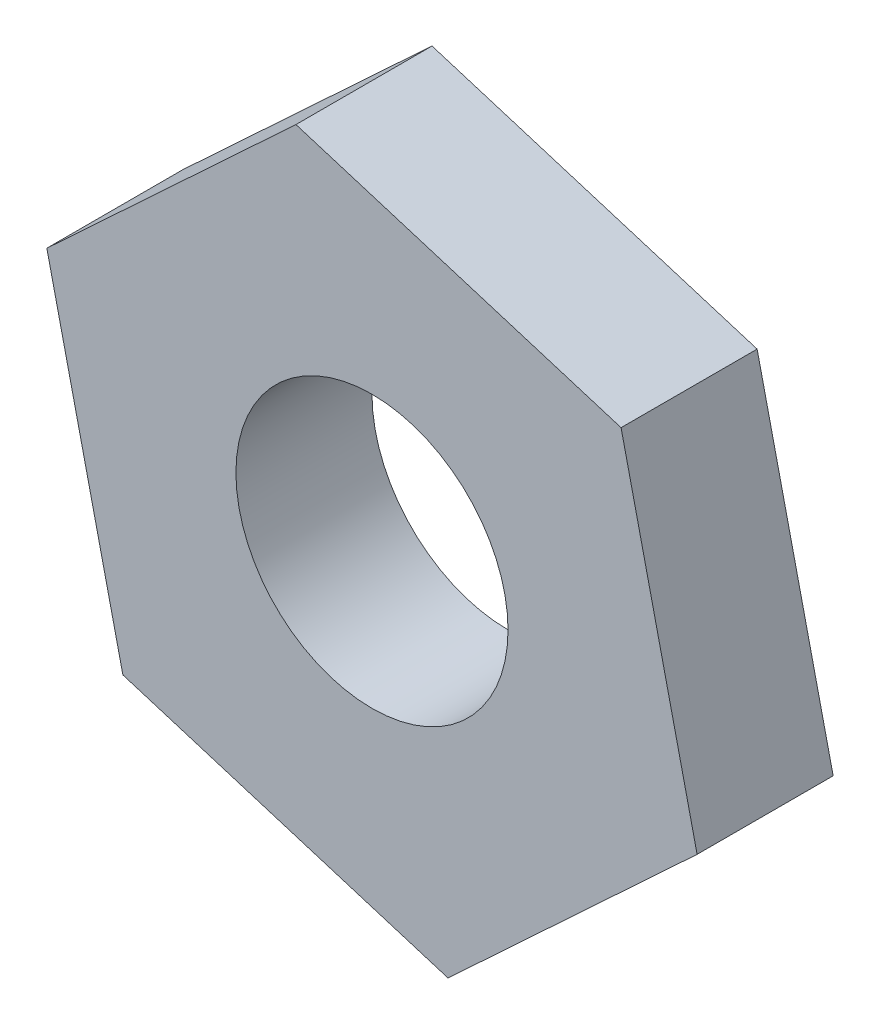
ISO-10303-21;
HEADER;
FILE_DESCRIPTION(('STEP AP214'),'2;1');
FILE_NAME('part.step','',(''),(''),'','','');
FILE_SCHEMA(('AUTOMOTIVE_DESIGN { 1 0 10303 214 1 1 1 1 }'));
ENDSEC;
DATA;
#1=APPLICATION_CONTEXT('core data for automotive mechanical design processes');
#2=APPLICATION_PROTOCOL_DEFINITION('international standard','automotive_design',2000,#1);
#3=PRODUCT_CONTEXT('',#1,'mechanical');
#4=PRODUCT('Part','Part','',(#3));
#5=PRODUCT_RELATED_PRODUCT_CATEGORY('part','',(#4));
#6=PRODUCT_DEFINITION_FORMATION('','',#4);
#7=PRODUCT_DEFINITION_CONTEXT('part definition',#1,'design');
#8=PRODUCT_DEFINITION('design','',#6,#7);
#9=PRODUCT_DEFINITION_SHAPE('','',#8);
#10=(LENGTH_UNIT() NAMED_UNIT(*) SI_UNIT(.MILLI.,.METRE.));
#11=(NAMED_UNIT(*) PLANE_ANGLE_UNIT() SI_UNIT($,.RADIAN.));
#12=(NAMED_UNIT(*) SI_UNIT($,.STERADIAN.) SOLID_ANGLE_UNIT());
#13=UNCERTAINTY_MEASURE_WITH_UNIT(LENGTH_MEASURE(1.E-05),#10,'distance_accuracy_value','');
#14=(GEOMETRIC_REPRESENTATION_CONTEXT(3) GLOBAL_UNCERTAINTY_ASSIGNED_CONTEXT((#13)) GLOBAL_UNIT_ASSIGNED_CONTEXT((#10,
#11,#12)) REPRESENTATION_CONTEXT('',''));
#15=CARTESIAN_POINT('',(0.,0.,0.));
#16=DIRECTION('',(0.,0.,1.));
#17=DIRECTION('',(1.,0.,0.));
#18=AXIS2_PLACEMENT_3D('',#15,#16,#17);
#19=CARTESIAN_POINT('',(-2.23532656778583,9.74696440618056,4.));
#20=DIRECTION('',(0.680933179654709,-0.732345550164216,0.));
#21=DIRECTION('',(0.732345550164216,0.680933179654709,0.));
#22=AXIS2_PLACEMENT_3D('',#19,#20,#21);
#23=PLANE('',#22);
#24=DIRECTION('',(-0.732345550164216,-0.680933179654709,0.));
#25=VECTOR('',#24,1.);
#26=CARTESIAN_POINT('',(-2.23532656778583,9.74696440618056,0.));
#27=LINE('',#26,#25);
#28=CARTESIAN_POINT('',(-2.23532656778583,9.74696440618056,0.));
#29=VERTEX_POINT('',#28);
#30=CARTESIAN_POINT('',(-9.55878206942799,2.93763260963347,0.));
#31=VERTEX_POINT('',#30);
#32=EDGE_CURVE('E128',#29,#31,#27,.T.);
#33=ORIENTED_EDGE('',*,*,#32,.T.);
#34=DIRECTION('',(0.,0.,-1.));
#35=VECTOR('',#34,1.);
#36=CARTESIAN_POINT('',(-9.55878206942799,2.93763260963347,4.));
#37=LINE('',#36,#35);
#38=CARTESIAN_POINT('',(-9.55878206942799,2.93763260963347,4.));
#39=VERTEX_POINT('',#38);
#40=EDGE_CURVE('E11',#39,#31,#37,.T.);
#41=ORIENTED_EDGE('',*,*,#40,.F.);
#42=DIRECTION('',(-0.732345550164216,-0.680933179654709,0.));
#43=VECTOR('',#42,1.);
#44=CARTESIAN_POINT('',(-2.23532656778583,9.74696440618056,4.));
#45=LINE('',#44,#43);
#46=CARTESIAN_POINT('',(-2.23532656778583,9.74696440618056,4.));
#47=VERTEX_POINT('',#46);
#48=EDGE_CURVE('E145',#47,#39,#45,.T.);
#49=ORIENTED_EDGE('',*,*,#48,.F.);
#50=DIRECTION('',(0.,0.,-1.));
#51=VECTOR('',#50,1.);
#52=CARTESIAN_POINT('',(-2.23532656778583,9.74696440618056,4.));
#53=LINE('',#52,#51);
#54=EDGE_CURVE('E124',#47,#29,#53,.T.);
#55=ORIENTED_EDGE('',*,*,#54,.T.);
#56=EDGE_LOOP('',(#33,#41,#49,#55));
#57=FACE_BOUND('',#56,.T.);
#58=ADVANCED_FACE('F39',(#57),#23,.F.);
#59=CARTESIAN_POINT('',(-9.55878206942799,2.93763260963347,4.));
#60=DIRECTION('',(0.974696440618056,0.223532656778583,0.));
#61=DIRECTION('',(-0.223532656778583,0.974696440618056,0.));
#62=AXIS2_PLACEMENT_3D('',#59,#60,#61);
#63=PLANE('',#62);
#64=DIRECTION('',(0.223532656778583,-0.974696440618056,0.));
#65=VECTOR('',#64,1.);
#66=CARTESIAN_POINT('',(-9.55878206942799,2.93763260963347,0.));
#67=LINE('',#66,#65);
#68=CARTESIAN_POINT('',(-7.32345550164216,-6.80933179654708,0.));
#69=VERTEX_POINT('',#68);
#70=EDGE_CURVE('E132',#31,#69,#67,.T.);
#71=ORIENTED_EDGE('',*,*,#70,.T.);
#72=DIRECTION('',(0.,0.,-1.));
#73=VECTOR('',#72,1.);
#74=CARTESIAN_POINT('',(-7.32345550164216,-6.80933179654708,4.));
#75=LINE('',#74,#73);
#76=CARTESIAN_POINT('',(-7.32345550164216,-6.80933179654708,4.));
#77=VERTEX_POINT('',#76);
#78=EDGE_CURVE('E48',#77,#69,#75,.T.);
#79=ORIENTED_EDGE('',*,*,#78,.F.);
#80=DIRECTION('',(0.223532656778583,-0.974696440618056,0.));
#81=VECTOR('',#80,1.);
#82=CARTESIAN_POINT('',(-9.55878206942799,2.93763260963347,4.));
#83=LINE('',#82,#81);
#84=EDGE_CURVE('E93',#39,#77,#83,.T.);
#85=ORIENTED_EDGE('',*,*,#84,.F.);
#86=ORIENTED_EDGE('',*,*,#40,.T.);
#87=EDGE_LOOP('',(#71,#79,#85,#86));
#88=FACE_BOUND('',#87,.T.);
#89=ADVANCED_FACE('F174',(#88),#63,.F.);
#90=CARTESIAN_POINT('',(-7.32345550164216,-6.80933179654708,4.));
#91=DIRECTION('',(0.293763260963348,0.955878206942799,0.));
#92=DIRECTION('',(-0.955878206942799,0.293763260963348,0.));
#93=AXIS2_PLACEMENT_3D('',#90,#91,#92);
#94=PLANE('',#93);
#95=DIRECTION('',(0.955878206942799,-0.293763260963348,0.));
#96=VECTOR('',#95,1.);
#97=CARTESIAN_POINT('',(-7.32345550164216,-6.80933179654708,0.));
#98=LINE('',#97,#96);
#99=CARTESIAN_POINT('',(2.23532656778583,-9.74696440618056,0.));
#100=VERTEX_POINT('',#99);
#101=EDGE_CURVE('E136',#69,#100,#98,.T.);
#102=ORIENTED_EDGE('',*,*,#101,.T.);
#103=DIRECTION('',(0.,0.,-1.));
#104=VECTOR('',#103,1.);
#105=CARTESIAN_POINT('',(2.23532656778583,-9.74696440618056,4.));
#106=LINE('',#105,#104);
#107=CARTESIAN_POINT('',(2.23532656778583,-9.74696440618056,4.));
#108=VERTEX_POINT('',#107);
#109=EDGE_CURVE('E117',#108,#100,#106,.T.);
#110=ORIENTED_EDGE('',*,*,#109,.F.);
#111=DIRECTION('',(0.955878206942799,-0.293763260963348,0.));
#112=VECTOR('',#111,1.);
#113=CARTESIAN_POINT('',(-7.32345550164216,-6.80933179654708,4.));
#114=LINE('',#113,#112);
#115=EDGE_CURVE('E106',#77,#108,#114,.T.);
#116=ORIENTED_EDGE('',*,*,#115,.F.);
#117=ORIENTED_EDGE('',*,*,#78,.T.);
#118=EDGE_LOOP('',(#102,#110,#116,#117));
#119=FACE_BOUND('',#118,.T.);
#120=ADVANCED_FACE('F155',(#119),#94,.F.);
#121=CARTESIAN_POINT('',(2.23532656778583,-9.74696440618056,4.));
#122=DIRECTION('',(-0.680933179654709,0.732345550164216,0.));
#123=DIRECTION('',(-0.732345550164216,-0.680933179654709,0.));
#124=AXIS2_PLACEMENT_3D('',#121,#122,#123);
#125=PLANE('',#124);
#126=DIRECTION('',(0.732345550164216,0.680933179654709,0.));
#127=VECTOR('',#126,1.);
#128=CARTESIAN_POINT('',(2.23532656778583,-9.74696440618056,0.));
#129=LINE('',#128,#127);
#130=CARTESIAN_POINT('',(9.55878206942798,-2.93763260963347,0.));
#131=VERTEX_POINT('',#130);
#132=EDGE_CURVE('E115',#100,#131,#129,.T.);
#133=ORIENTED_EDGE('',*,*,#132,.T.);
#134=DIRECTION('',(0.,0.,-1.));
#135=VECTOR('',#134,1.);
#136=CARTESIAN_POINT('',(9.55878206942798,-2.93763260963347,4.));
#137=LINE('',#136,#135);
#138=CARTESIAN_POINT('',(9.55878206942798,-2.93763260963347,4.));
#139=VERTEX_POINT('',#138);
#140=EDGE_CURVE('E112',#139,#131,#137,.T.);
#141=ORIENTED_EDGE('',*,*,#140,.F.);
#142=DIRECTION('',(0.732345550164216,0.680933179654709,0.));
#143=VECTOR('',#142,1.);
#144=CARTESIAN_POINT('',(2.23532656778583,-9.74696440618056,4.));
#145=LINE('',#144,#143);
#146=EDGE_CURVE('E100',#108,#139,#145,.T.);
#147=ORIENTED_EDGE('',*,*,#146,.F.);
#148=ORIENTED_EDGE('',*,*,#109,.T.);
#149=EDGE_LOOP('',(#133,#141,#147,#148));
#150=FACE_BOUND('',#149,.T.);
#151=ADVANCED_FACE('F113',(#150),#125,.F.);
#152=CARTESIAN_POINT('',(9.55878206942798,-2.93763260963347,4.));
#153=DIRECTION('',(-0.974696440618056,-0.223532656778583,0.));
#154=DIRECTION('',(0.223532656778583,-0.974696440618056,0.));
#155=AXIS2_PLACEMENT_3D('',#152,#153,#154);
#156=PLANE('',#155);
#157=DIRECTION('',(-0.223532656778583,0.974696440618056,0.));
#158=VECTOR('',#157,1.);
#159=CARTESIAN_POINT('',(9.55878206942798,-2.93763260963347,0.));
#160=LINE('',#159,#158);
#161=CARTESIAN_POINT('',(7.32345550164215,6.80933179654709,0.));
#162=VERTEX_POINT('',#161);
#163=EDGE_CURVE('E79',#131,#162,#160,.T.);
#164=ORIENTED_EDGE('',*,*,#163,.T.);
#165=DIRECTION('',(0.,0.,-1.));
#166=VECTOR('',#165,1.);
#167=CARTESIAN_POINT('',(7.32345550164215,6.80933179654709,4.));
#168=LINE('',#167,#166);
#169=CARTESIAN_POINT('',(7.32345550164215,6.80933179654709,4.));
#170=VERTEX_POINT('',#169);
#171=EDGE_CURVE('E118',#170,#162,#168,.T.);
#172=ORIENTED_EDGE('',*,*,#171,.F.);
#173=DIRECTION('',(-0.223532656778583,0.974696440618056,0.));
#174=VECTOR('',#173,1.);
#175=CARTESIAN_POINT('',(9.55878206942798,-2.93763260963347,4.));
#176=LINE('',#175,#174);
#177=EDGE_CURVE('E104',#139,#170,#176,.T.);
#178=ORIENTED_EDGE('',*,*,#177,.F.);
#179=ORIENTED_EDGE('',*,*,#140,.T.);
#180=EDGE_LOOP('',(#164,#172,#178,#179));
#181=FACE_BOUND('',#180,.T.);
#182=ADVANCED_FACE('F120',(#181),#156,.F.);
#183=CARTESIAN_POINT('',(7.32345550164215,6.80933179654709,4.));
#184=DIRECTION('',(-0.293763260963347,-0.955878206942799,0.));
#185=DIRECTION('',(0.955878206942799,-0.293763260963348,0.));
#186=AXIS2_PLACEMENT_3D('',#183,#184,#185);
#187=PLANE('',#186);
#188=DIRECTION('',(-0.955878206942799,0.293763260963347,0.));
#189=VECTOR('',#188,1.);
#190=CARTESIAN_POINT('',(7.32345550164215,6.80933179654709,0.));
#191=LINE('',#190,#189);
#192=EDGE_CURVE('E85',#162,#29,#191,.T.);
#193=ORIENTED_EDGE('',*,*,#192,.T.);
#194=ORIENTED_EDGE('',*,*,#54,.F.);
#195=DIRECTION('',(-0.955878206942799,0.293763260963347,0.));
#196=VECTOR('',#195,1.);
#197=CARTESIAN_POINT('',(7.32345550164215,6.80933179654709,4.));
#198=LINE('',#197,#196);
#199=EDGE_CURVE('E56',#170,#47,#198,.T.);
#200=ORIENTED_EDGE('',*,*,#199,.F.);
#201=ORIENTED_EDGE('',*,*,#171,.T.);
#202=EDGE_LOOP('',(#193,#194,#200,#201));
#203=FACE_BOUND('',#202,.T.);
#204=ADVANCED_FACE('F162',(#203),#187,.F.);
#205=CARTESIAN_POINT('',(0.,0.,4.));
#206=DIRECTION('',(0.,0.,1.));
#207=DIRECTION('',(1.,0.,0.));
#208=AXIS2_PLACEMENT_3D('',#205,#206,#207);
#209=PLANE('',#208);
#210=CARTESIAN_POINT('',(0.,0.,4.));
#211=DIRECTION('',(0.,0.,1.));
#212=DIRECTION('',(1.,0.,0.));
#213=AXIS2_PLACEMENT_3D('',#210,#211,#212);
#214=CIRCLE('',#213,4.);
#215=CARTESIAN_POINT('',(4.,0.,4.));
#216=VERTEX_POINT('',#215);
#217=EDGE_CURVE('E229',#216,#216,#214,.T.);
#218=ORIENTED_EDGE('',*,*,#217,.F.);
#219=EDGE_LOOP('',(#218));
#220=FACE_BOUND('',#219,.T.);
#221=ORIENTED_EDGE('',*,*,#48,.T.);
#222=ORIENTED_EDGE('',*,*,#84,.T.);
#223=ORIENTED_EDGE('',*,*,#115,.T.);
#224=ORIENTED_EDGE('',*,*,#146,.T.);
#225=ORIENTED_EDGE('',*,*,#177,.T.);
#226=ORIENTED_EDGE('',*,*,#199,.T.);
#227=EDGE_LOOP('',(#221,#222,#223,#224,#225,#226));
#228=FACE_BOUND('',#227,.T.);
#229=ADVANCED_FACE('F102',(#220,#228),#209,.T.);
#230=CARTESIAN_POINT('',(0.,0.,0.));
#231=DIRECTION('',(0.,0.,1.));
#232=DIRECTION('',(1.,0.,0.));
#233=AXIS2_PLACEMENT_3D('',#230,#231,#232);
#234=PLANE('',#233);
#235=CARTESIAN_POINT('',(0.,0.,0.));
#236=DIRECTION('',(0.,0.,1.));
#237=DIRECTION('',(1.,0.,0.));
#238=AXIS2_PLACEMENT_3D('',#235,#236,#237);
#239=CIRCLE('',#238,4.);
#240=CARTESIAN_POINT('',(4.,0.,0.));
#241=VERTEX_POINT('',#240);
#242=EDGE_CURVE('E133',#241,#241,#239,.T.);
#243=ORIENTED_EDGE('',*,*,#242,.T.);
#244=EDGE_LOOP('',(#243));
#245=FACE_BOUND('',#244,.T.);
#246=ORIENTED_EDGE('',*,*,#32,.F.);
#247=ORIENTED_EDGE('',*,*,#192,.F.);
#248=ORIENTED_EDGE('',*,*,#163,.F.);
#249=ORIENTED_EDGE('',*,*,#132,.F.);
#250=ORIENTED_EDGE('',*,*,#101,.F.);
#251=ORIENTED_EDGE('',*,*,#70,.F.);
#252=EDGE_LOOP('',(#246,#247,#248,#249,#250,#251));
#253=FACE_BOUND('',#252,.T.);
#254=ADVANCED_FACE('F158',(#245,#253),#234,.F.);
#255=CARTESIAN_POINT('',(0.,0.,0.));
#256=DIRECTION('',(0.,0.,1.));
#257=DIRECTION('',(1.,0.,0.));
#258=AXIS2_PLACEMENT_3D('',#255,#256,#257);
#259=CYLINDRICAL_SURFACE('',#258,4.);
#260=ORIENTED_EDGE('',*,*,#242,.F.);
#261=EDGE_LOOP('',(#260));
#262=FACE_BOUND('',#261,.T.);
#263=ORIENTED_EDGE('',*,*,#217,.T.);
#264=EDGE_LOOP('',(#263));
#265=FACE_BOUND('',#264,.T.);
#266=ADVANCED_FACE('F211',(#262,#265),#259,.F.);
#267=CLOSED_SHELL('',(#58,#89,#120,#151,#182,#204,#229,#254,#266));
#268=MANIFOLD_SOLID_BREP('B2',#267);
#269=ADVANCED_BREP_SHAPE_REPRESENTATION('',(#18,#268),#14);
#270=SHAPE_DEFINITION_REPRESENTATION(#9,#269);
ENDSEC;
END-ISO-10303-21;
